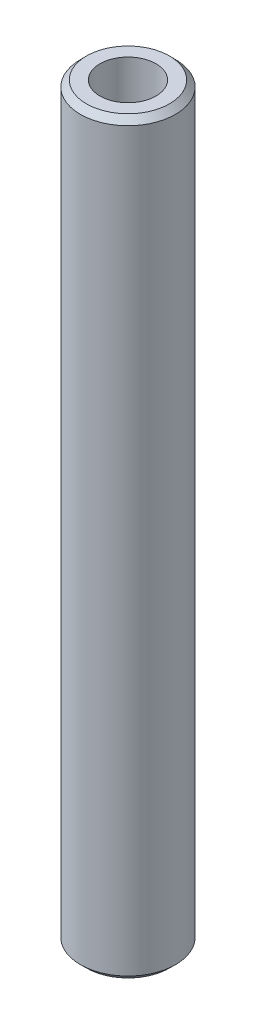
ISO-10303-21;
HEADER;
FILE_DESCRIPTION(('STEP AP214'),'2;1');
FILE_NAME('part.step','',(''),(''),'','','');
FILE_SCHEMA(('AUTOMOTIVE_DESIGN { 1 0 10303 214 1 1 1 1 }'));
ENDSEC;
DATA;
#1=APPLICATION_CONTEXT('core data for automotive mechanical design processes');
#2=APPLICATION_PROTOCOL_DEFINITION('international standard','automotive_design',2000,#1);
#3=PRODUCT_CONTEXT('',#1,'mechanical');
#4=PRODUCT('Part','Part','',(#3));
#5=PRODUCT_RELATED_PRODUCT_CATEGORY('part','',(#4));
#6=PRODUCT_DEFINITION_FORMATION('','',#4);
#7=PRODUCT_DEFINITION_CONTEXT('part definition',#1,'design');
#8=PRODUCT_DEFINITION('design','',#6,#7);
#9=PRODUCT_DEFINITION_SHAPE('','',#8);
#10=(LENGTH_UNIT() NAMED_UNIT(*) SI_UNIT(.MILLI.,.METRE.));
#11=(NAMED_UNIT(*) PLANE_ANGLE_UNIT() SI_UNIT($,.RADIAN.));
#12=(NAMED_UNIT(*) SI_UNIT($,.STERADIAN.) SOLID_ANGLE_UNIT());
#13=UNCERTAINTY_MEASURE_WITH_UNIT(LENGTH_MEASURE(1.E-05),#10,'distance_accuracy_value','');
#14=(GEOMETRIC_REPRESENTATION_CONTEXT(3) GLOBAL_UNCERTAINTY_ASSIGNED_CONTEXT((#13)) GLOBAL_UNIT_ASSIGNED_CONTEXT((#10,
#11,#12)) REPRESENTATION_CONTEXT('',''));
#15=CARTESIAN_POINT('',(0.,0.,0.));
#16=DIRECTION('',(0.,0.,1.));
#17=DIRECTION('',(1.,0.,0.));
#18=AXIS2_PLACEMENT_3D('',#15,#16,#17);
#19=CARTESIAN_POINT('',(0.,590.780436453815,0.));
#20=DIRECTION('',(0.,-1.,0.));
#21=DIRECTION('',(0.,0.,-1.));
#22=AXIS2_PLACEMENT_3D('',#19,#20,#21);
#23=CYLINDRICAL_SURFACE('',#22,37.5);
#24=CARTESIAN_POINT('',(0.,585.941201062355,0.));
#25=DIRECTION('',(0.,1.,0.));
#26=DIRECTION('',(0.,0.,1.));
#27=AXIS2_PLACEMENT_3D('',#24,#25,#26);
#28=CIRCLE('',#27,37.5);
#29=CARTESIAN_POINT('',(0.,585.941201062355,37.5));
#30=VERTEX_POINT('',#29);
#31=EDGE_CURVE('E50',#30,#30,#28,.F.);
#32=ORIENTED_EDGE('',*,*,#31,.T.);
#33=EDGE_LOOP('',(#32));
#34=FACE_BOUND('',#33,.T.);
#35=CARTESIAN_POINT('',(0.,4.7408282132696,0.));
#36=DIRECTION('',(0.,1.,0.));
#37=DIRECTION('',(0.,0.,1.));
#38=AXIS2_PLACEMENT_3D('',#35,#36,#37);
#39=CIRCLE('',#38,37.5);
#40=CARTESIAN_POINT('',(0.,4.7408282132696,37.5));
#41=VERTEX_POINT('',#40);
#42=EDGE_CURVE('E51',#41,#41,#39,.T.);
#43=ORIENTED_EDGE('',*,*,#42,.T.);
#44=EDGE_LOOP('',(#43));
#45=FACE_BOUND('',#44,.T.);
#46=ADVANCED_FACE('F39',(#34,#45),#23,.T.);
#47=CARTESIAN_POINT('',(0.,590.780436453815,0.));
#48=DIRECTION('',(0.,1.,0.));
#49=DIRECTION('',(0.,0.,1.));
#50=AXIS2_PLACEMENT_3D('',#47,#48,#49);
#51=PLANE('',#50);
#52=CARTESIAN_POINT('',(0.,590.780436453815,0.));
#53=DIRECTION('',(0.,1.,0.));
#54=DIRECTION('',(0.,0.,1.));
#55=AXIS2_PLACEMENT_3D('',#52,#53,#54);
#56=CIRCLE('',#55,32.7591717867303);
#57=CARTESIAN_POINT('',(0.,590.780436453815,32.7591717867303));
#58=VERTEX_POINT('',#57);
#59=EDGE_CURVE('E54',#58,#58,#56,.T.);
#60=ORIENTED_EDGE('',*,*,#59,.T.);
#61=EDGE_LOOP('',(#60));
#62=FACE_BOUND('',#61,.T.);
#63=CARTESIAN_POINT('',(0.,590.780436453815,0.));
#64=DIRECTION('',(0.,1.,0.));
#65=DIRECTION('',(0.,0.,1.));
#66=AXIS2_PLACEMENT_3D('',#63,#64,#65);
#67=CIRCLE('',#66,22.1140980900979);
#68=CARTESIAN_POINT('',(0.,590.780436453815,22.1140980900979));
#69=VERTEX_POINT('',#68);
#70=EDGE_CURVE('E58',#69,#69,#67,.T.);
#71=ORIENTED_EDGE('',*,*,#70,.F.);
#72=EDGE_LOOP('',(#71));
#73=FACE_BOUND('',#72,.T.);
#74=ADVANCED_FACE('F69',(#62,#73),#51,.T.);
#75=CARTESIAN_POINT('',(0.,0.,0.));
#76=DIRECTION('',(0.,1.,0.));
#77=DIRECTION('',(0.,0.,1.));
#78=AXIS2_PLACEMENT_3D('',#75,#76,#77);
#79=PLANE('',#78);
#80=CARTESIAN_POINT('',(0.,0.,0.));
#81=DIRECTION('',(0.,1.,0.));
#82=DIRECTION('',(0.,0.,1.));
#83=AXIS2_PLACEMENT_3D('',#80,#81,#82);
#84=CIRCLE('',#83,32.6607646085406);
#85=CARTESIAN_POINT('',(0.,0.,32.6607646085406));
#86=VERTEX_POINT('',#85);
#87=EDGE_CURVE('E10',#86,#86,#84,.F.);
#88=ORIENTED_EDGE('',*,*,#87,.T.);
#89=EDGE_LOOP('',(#88));
#90=FACE_BOUND('',#89,.T.);
#91=CARTESIAN_POINT('',(0.,0.,0.));
#92=DIRECTION('',(0.,1.,0.));
#93=DIRECTION('',(0.,0.,1.));
#94=AXIS2_PLACEMENT_3D('',#91,#92,#93);
#95=CIRCLE('',#94,22.1140980900979);
#96=CARTESIAN_POINT('',(0.,0.,22.1140980900979));
#97=VERTEX_POINT('',#96);
#98=EDGE_CURVE('E63',#97,#97,#95,.T.);
#99=ORIENTED_EDGE('',*,*,#98,.T.);
#100=EDGE_LOOP('',(#99));
#101=FACE_BOUND('',#100,.T.);
#102=ADVANCED_FACE('F75',(#90,#101),#79,.F.);
#103=CARTESIAN_POINT('',(0.,590.780436453815,0.));
#104=DIRECTION('',(0.,-1.,0.));
#105=DIRECTION('',(0.,0.,-1.));
#106=AXIS2_PLACEMENT_3D('',#103,#104,#105);
#107=CYLINDRICAL_SURFACE('',#106,22.1140980900979);
#108=ORIENTED_EDGE('',*,*,#70,.T.);
#109=EDGE_LOOP('',(#108));
#110=FACE_BOUND('',#109,.T.);
#111=ORIENTED_EDGE('',*,*,#98,.F.);
#112=EDGE_LOOP('',(#111));
#113=FACE_BOUND('',#112,.T.);
#114=ADVANCED_FACE('F70',(#110,#113),#107,.F.);
#115=CARTESIAN_POINT('',(0.,590.780436453815,0.));
#116=DIRECTION('',(0.,-1.,0.));
#117=DIRECTION('',(0.,0.,-1.));
#118=AXIS2_PLACEMENT_3D('',#115,#116,#117);
#119=CONICAL_SURFACE('',#118,32.7591717867303,0.775126444826047);
#120=ORIENTED_EDGE('',*,*,#31,.F.);
#121=EDGE_LOOP('',(#120));
#122=FACE_BOUND('',#121,.T.);
#123=ORIENTED_EDGE('',*,*,#59,.F.);
#124=EDGE_LOOP('',(#123));
#125=FACE_BOUND('',#124,.T.);
#126=ADVANCED_FACE('F81',(#122,#125),#119,.T.);
#127=CARTESIAN_POINT('',(0.,4.7408282132696,0.));
#128=DIRECTION('',(0.,1.,0.));
#129=DIRECTION('',(0.,0.,1.));
#130=AXIS2_PLACEMENT_3D('',#127,#128,#129);
#131=CONICAL_SURFACE('',#130,37.5,0.795669881968861);
#132=ORIENTED_EDGE('',*,*,#87,.F.);
#133=EDGE_LOOP('',(#132));
#134=FACE_BOUND('',#133,.T.);
#135=ORIENTED_EDGE('',*,*,#42,.F.);
#136=EDGE_LOOP('',(#135));
#137=FACE_BOUND('',#136,.T.);
#138=ADVANCED_FACE('F45',(#134,#137),#131,.T.);
#139=CLOSED_SHELL('',(#46,#74,#102,#114,#126,#138));
#140=MANIFOLD_SOLID_BREP('B2',#139);
#141=ADVANCED_BREP_SHAPE_REPRESENTATION('',(#18,#140),#14);
#142=SHAPE_DEFINITION_REPRESENTATION(#9,#141);
ENDSEC;
END-ISO-10303-21;
